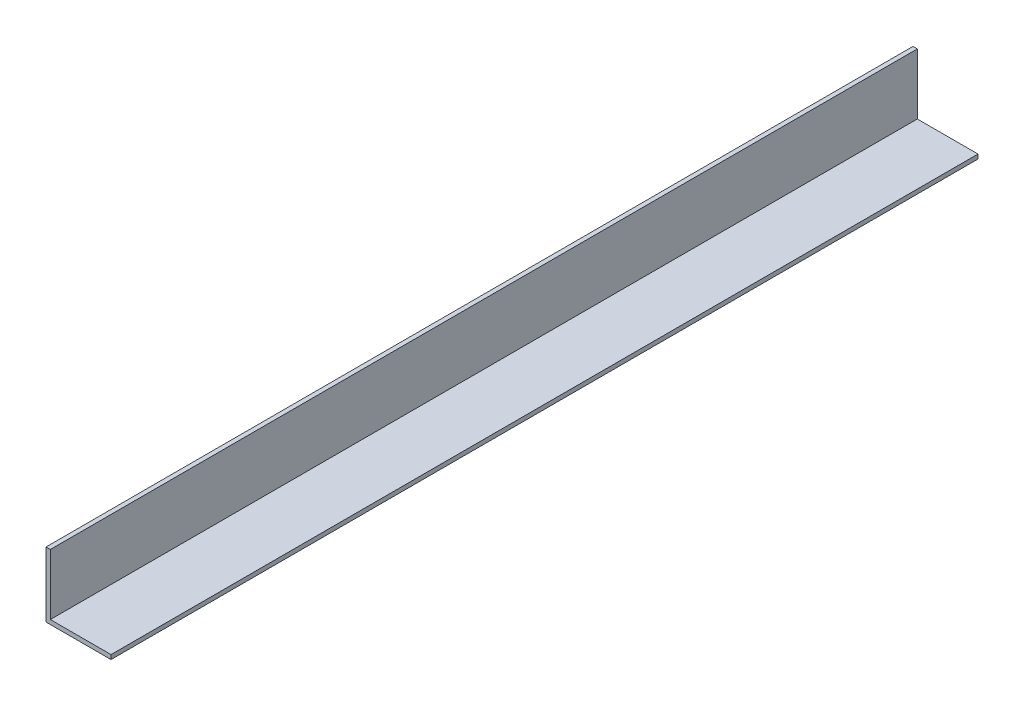
ISO-10303-21;
HEADER;
FILE_DESCRIPTION(('STEP AP214'),'2;1');
FILE_NAME('part.step','',(''),(''),'','','');
FILE_SCHEMA(('AUTOMOTIVE_DESIGN { 1 0 10303 214 1 1 1 1 }'));
ENDSEC;
DATA;
#1=APPLICATION_CONTEXT('core data for automotive mechanical design processes');
#2=APPLICATION_PROTOCOL_DEFINITION('international standard','automotive_design',2000,#1);
#3=PRODUCT_CONTEXT('',#1,'mechanical');
#4=PRODUCT('Part','Part','',(#3));
#5=PRODUCT_RELATED_PRODUCT_CATEGORY('part','',(#4));
#6=PRODUCT_DEFINITION_FORMATION('','',#4);
#7=PRODUCT_DEFINITION_CONTEXT('part definition',#1,'design');
#8=PRODUCT_DEFINITION('design','',#6,#7);
#9=PRODUCT_DEFINITION_SHAPE('','',#8);
#10=(LENGTH_UNIT() NAMED_UNIT(*) SI_UNIT(.MILLI.,.METRE.));
#11=(NAMED_UNIT(*) PLANE_ANGLE_UNIT() SI_UNIT($,.RADIAN.));
#12=(NAMED_UNIT(*) SI_UNIT($,.STERADIAN.) SOLID_ANGLE_UNIT());
#13=UNCERTAINTY_MEASURE_WITH_UNIT(LENGTH_MEASURE(1.E-05),#10,'distance_accuracy_value','');
#14=(GEOMETRIC_REPRESENTATION_CONTEXT(3) GLOBAL_UNCERTAINTY_ASSIGNED_CONTEXT((#13)) GLOBAL_UNIT_ASSIGNED_CONTEXT((#10,
#11,#12)) REPRESENTATION_CONTEXT('',''));
#15=CARTESIAN_POINT('',(0.,0.,0.));
#16=DIRECTION('',(0.,0.,1.));
#17=DIRECTION('',(1.,0.,0.));
#18=AXIS2_PLACEMENT_3D('',#15,#16,#17);
#19=CARTESIAN_POINT('',(0.,15.,200.));
#20=DIRECTION('',(1.,0.,0.));
#21=DIRECTION('',(0.,0.,-1.));
#22=AXIS2_PLACEMENT_3D('',#19,#20,#21);
#23=PLANE('',#22);
#24=DIRECTION('',(0.,-1.,0.));
#25=VECTOR('',#24,1.);
#26=CARTESIAN_POINT('',(0.,15.,0.));
#27=LINE('',#26,#25);
#28=CARTESIAN_POINT('',(0.,15.,0.));
#29=VERTEX_POINT('',#28);
#30=CARTESIAN_POINT('',(0.,0.,0.));
#31=VERTEX_POINT('',#30);
#32=EDGE_CURVE('E119',#29,#31,#27,.T.);
#33=ORIENTED_EDGE('',*,*,#32,.T.);
#34=DIRECTION('',(0.,0.,-1.));
#35=VECTOR('',#34,1.);
#36=CARTESIAN_POINT('',(0.,0.,200.));
#37=LINE('',#36,#35);
#38=CARTESIAN_POINT('',(0.,0.,200.));
#39=VERTEX_POINT('',#38);
#40=EDGE_CURVE('E11',#39,#31,#37,.T.);
#41=ORIENTED_EDGE('',*,*,#40,.F.);
#42=DIRECTION('',(0.,-1.,0.));
#43=VECTOR('',#42,1.);
#44=CARTESIAN_POINT('',(0.,15.,200.));
#45=LINE('',#44,#43);
#46=CARTESIAN_POINT('',(0.,15.,200.));
#47=VERTEX_POINT('',#46);
#48=EDGE_CURVE('E129',#47,#39,#45,.T.);
#49=ORIENTED_EDGE('',*,*,#48,.F.);
#50=DIRECTION('',(0.,0.,-1.));
#51=VECTOR('',#50,1.);
#52=CARTESIAN_POINT('',(0.,15.,200.));
#53=LINE('',#52,#51);
#54=EDGE_CURVE('E115',#47,#29,#53,.T.);
#55=ORIENTED_EDGE('',*,*,#54,.T.);
#56=EDGE_LOOP('',(#33,#41,#49,#55));
#57=FACE_BOUND('',#56,.T.);
#58=ADVANCED_FACE('F35',(#57),#23,.F.);
#59=CARTESIAN_POINT('',(0.,0.,200.));
#60=DIRECTION('',(0.,1.,0.));
#61=DIRECTION('',(0.,0.,1.));
#62=AXIS2_PLACEMENT_3D('',#59,#60,#61);
#63=PLANE('',#62);
#64=DIRECTION('',(1.,0.,0.));
#65=VECTOR('',#64,1.);
#66=CARTESIAN_POINT('',(0.,0.,0.));
#67=LINE('',#66,#65);
#68=CARTESIAN_POINT('',(15.,0.,0.));
#69=VERTEX_POINT('',#68);
#70=EDGE_CURVE('E122',#31,#69,#67,.T.);
#71=ORIENTED_EDGE('',*,*,#70,.T.);
#72=DIRECTION('',(0.,0.,-1.));
#73=VECTOR('',#72,1.);
#74=CARTESIAN_POINT('',(15.,0.,200.));
#75=LINE('',#74,#73);
#76=CARTESIAN_POINT('',(15.,0.,200.));
#77=VERTEX_POINT('',#76);
#78=EDGE_CURVE('E43',#77,#69,#75,.T.);
#79=ORIENTED_EDGE('',*,*,#78,.F.);
#80=DIRECTION('',(1.,0.,0.));
#81=VECTOR('',#80,1.);
#82=CARTESIAN_POINT('',(0.,0.,200.));
#83=LINE('',#82,#81);
#84=EDGE_CURVE('E88',#39,#77,#83,.T.);
#85=ORIENTED_EDGE('',*,*,#84,.F.);
#86=ORIENTED_EDGE('',*,*,#40,.T.);
#87=EDGE_LOOP('',(#71,#79,#85,#86));
#88=FACE_BOUND('',#87,.T.);
#89=ADVANCED_FACE('F153',(#88),#63,.F.);
#90=CARTESIAN_POINT('',(15.,0.,200.));
#91=DIRECTION('',(-1.,0.,0.));
#92=DIRECTION('',(0.,0.,1.));
#93=AXIS2_PLACEMENT_3D('',#90,#91,#92);
#94=PLANE('',#93);
#95=DIRECTION('',(0.,1.,0.));
#96=VECTOR('',#95,1.);
#97=CARTESIAN_POINT('',(15.,0.,0.));
#98=LINE('',#97,#96);
#99=CARTESIAN_POINT('',(15.,1.,0.));
#100=VERTEX_POINT('',#99);
#101=EDGE_CURVE('E124',#69,#100,#98,.T.);
#102=ORIENTED_EDGE('',*,*,#101,.T.);
#103=DIRECTION('',(0.,0.,-1.));
#104=VECTOR('',#103,1.);
#105=CARTESIAN_POINT('',(15.,1.,200.));
#106=LINE('',#105,#104);
#107=CARTESIAN_POINT('',(15.,1.,200.));
#108=VERTEX_POINT('',#107);
#109=EDGE_CURVE('E110',#108,#100,#106,.T.);
#110=ORIENTED_EDGE('',*,*,#109,.F.);
#111=DIRECTION('',(0.,1.,0.));
#112=VECTOR('',#111,1.);
#113=CARTESIAN_POINT('',(15.,0.,200.));
#114=LINE('',#113,#112);
#115=EDGE_CURVE('E101',#77,#108,#114,.T.);
#116=ORIENTED_EDGE('',*,*,#115,.F.);
#117=ORIENTED_EDGE('',*,*,#78,.T.);
#118=EDGE_LOOP('',(#102,#110,#116,#117));
#119=FACE_BOUND('',#118,.T.);
#120=ADVANCED_FACE('F135',(#119),#94,.F.);
#121=CARTESIAN_POINT('',(15.,1.,200.));
#122=DIRECTION('',(0.,-1.,0.));
#123=DIRECTION('',(1.,0.,0.));
#124=AXIS2_PLACEMENT_3D('',#121,#122,#123);
#125=PLANE('',#124);
#126=DIRECTION('',(-1.,0.,0.));
#127=VECTOR('',#126,1.);
#128=CARTESIAN_POINT('',(15.,1.,0.));
#129=LINE('',#128,#127);
#130=CARTESIAN_POINT('',(1.,0.999999999999998,0.));
#131=VERTEX_POINT('',#130);
#132=EDGE_CURVE('E109',#100,#131,#129,.T.);
#133=ORIENTED_EDGE('',*,*,#132,.T.);
#134=DIRECTION('',(0.,0.,-1.));
#135=VECTOR('',#134,1.);
#136=CARTESIAN_POINT('',(1.,0.999999999999998,200.));
#137=LINE('',#136,#135);
#138=CARTESIAN_POINT('',(1.,0.999999999999998,200.));
#139=VERTEX_POINT('',#138);
#140=EDGE_CURVE('E106',#139,#131,#137,.T.);
#141=ORIENTED_EDGE('',*,*,#140,.F.);
#142=DIRECTION('',(-1.,0.,0.));
#143=VECTOR('',#142,1.);
#144=CARTESIAN_POINT('',(15.,1.,200.));
#145=LINE('',#144,#143);
#146=EDGE_CURVE('E95',#108,#139,#145,.T.);
#147=ORIENTED_EDGE('',*,*,#146,.F.);
#148=ORIENTED_EDGE('',*,*,#109,.T.);
#149=EDGE_LOOP('',(#133,#141,#147,#148));
#150=FACE_BOUND('',#149,.T.);
#151=ADVANCED_FACE('F107',(#150),#125,.F.);
#152=CARTESIAN_POINT('',(1.,0.999999999999998,200.));
#153=DIRECTION('',(-1.,0.,0.));
#154=DIRECTION('',(0.,-1.,0.));
#155=AXIS2_PLACEMENT_3D('',#152,#153,#154);
#156=PLANE('',#155);
#157=DIRECTION('',(0.,1.,0.));
#158=VECTOR('',#157,1.);
#159=CARTESIAN_POINT('',(1.,0.999999999999998,0.));
#160=LINE('',#159,#158);
#161=CARTESIAN_POINT('',(1.,15.,0.));
#162=VERTEX_POINT('',#161);
#163=EDGE_CURVE('E74',#131,#162,#160,.T.);
#164=ORIENTED_EDGE('',*,*,#163,.T.);
#165=DIRECTION('',(0.,0.,-1.));
#166=VECTOR('',#165,1.);
#167=CARTESIAN_POINT('',(1.,15.,200.));
#168=LINE('',#167,#166);
#169=CARTESIAN_POINT('',(1.,15.,200.));
#170=VERTEX_POINT('',#169);
#171=EDGE_CURVE('E111',#170,#162,#168,.T.);
#172=ORIENTED_EDGE('',*,*,#171,.F.);
#173=DIRECTION('',(0.,1.,0.));
#174=VECTOR('',#173,1.);
#175=CARTESIAN_POINT('',(1.,0.999999999999998,200.));
#176=LINE('',#175,#174);
#177=EDGE_CURVE('E99',#139,#170,#176,.T.);
#178=ORIENTED_EDGE('',*,*,#177,.F.);
#179=ORIENTED_EDGE('',*,*,#140,.T.);
#180=EDGE_LOOP('',(#164,#172,#178,#179));
#181=FACE_BOUND('',#180,.T.);
#182=ADVANCED_FACE('F113',(#181),#156,.F.);
#183=CARTESIAN_POINT('',(1.,15.,200.));
#184=DIRECTION('',(0.,-1.,0.));
#185=DIRECTION('',(0.,0.,-1.));
#186=AXIS2_PLACEMENT_3D('',#183,#184,#185);
#187=PLANE('',#186);
#188=DIRECTION('',(-1.,0.,0.));
#189=VECTOR('',#188,1.);
#190=CARTESIAN_POINT('',(1.,15.,0.));
#191=LINE('',#190,#189);
#192=EDGE_CURVE('E80',#162,#29,#191,.T.);
#193=ORIENTED_EDGE('',*,*,#192,.T.);
#194=ORIENTED_EDGE('',*,*,#54,.F.);
#195=DIRECTION('',(-1.,0.,0.));
#196=VECTOR('',#195,1.);
#197=CARTESIAN_POINT('',(1.,15.,200.));
#198=LINE('',#197,#196);
#199=EDGE_CURVE('E51',#170,#47,#198,.T.);
#200=ORIENTED_EDGE('',*,*,#199,.F.);
#201=ORIENTED_EDGE('',*,*,#171,.T.);
#202=EDGE_LOOP('',(#193,#194,#200,#201));
#203=FACE_BOUND('',#202,.T.);
#204=ADVANCED_FACE('F142',(#203),#187,.F.);
#205=CARTESIAN_POINT('',(0.,0.,200.));
#206=DIRECTION('',(0.,0.,1.));
#207=DIRECTION('',(1.,0.,0.));
#208=AXIS2_PLACEMENT_3D('',#205,#206,#207);
#209=PLANE('',#208);
#210=ORIENTED_EDGE('',*,*,#48,.T.);
#211=ORIENTED_EDGE('',*,*,#84,.T.);
#212=ORIENTED_EDGE('',*,*,#115,.T.);
#213=ORIENTED_EDGE('',*,*,#146,.T.);
#214=ORIENTED_EDGE('',*,*,#177,.T.);
#215=ORIENTED_EDGE('',*,*,#199,.T.);
#216=EDGE_LOOP('',(#210,#211,#212,#213,#214,#215));
#217=FACE_BOUND('',#216,.T.);
#218=ADVANCED_FACE('F97',(#217),#209,.T.);
#219=CARTESIAN_POINT('',(0.,0.,0.));
#220=DIRECTION('',(0.,0.,1.));
#221=DIRECTION('',(1.,0.,0.));
#222=AXIS2_PLACEMENT_3D('',#219,#220,#221);
#223=PLANE('',#222);
#224=ORIENTED_EDGE('',*,*,#32,.F.);
#225=ORIENTED_EDGE('',*,*,#192,.F.);
#226=ORIENTED_EDGE('',*,*,#163,.F.);
#227=ORIENTED_EDGE('',*,*,#132,.F.);
#228=ORIENTED_EDGE('',*,*,#101,.F.);
#229=ORIENTED_EDGE('',*,*,#70,.F.);
#230=EDGE_LOOP('',(#224,#225,#226,#227,#228,#229));
#231=FACE_BOUND('',#230,.T.);
#232=ADVANCED_FACE('F138',(#231),#223,.F.);
#233=CLOSED_SHELL('',(#58,#89,#120,#151,#182,#204,#218,#232));
#234=MANIFOLD_SOLID_BREP('B2',#233);
#235=ADVANCED_BREP_SHAPE_REPRESENTATION('',(#18,#234),#14);
#236=SHAPE_DEFINITION_REPRESENTATION(#9,#235);
ENDSEC;
END-ISO-10303-21;
